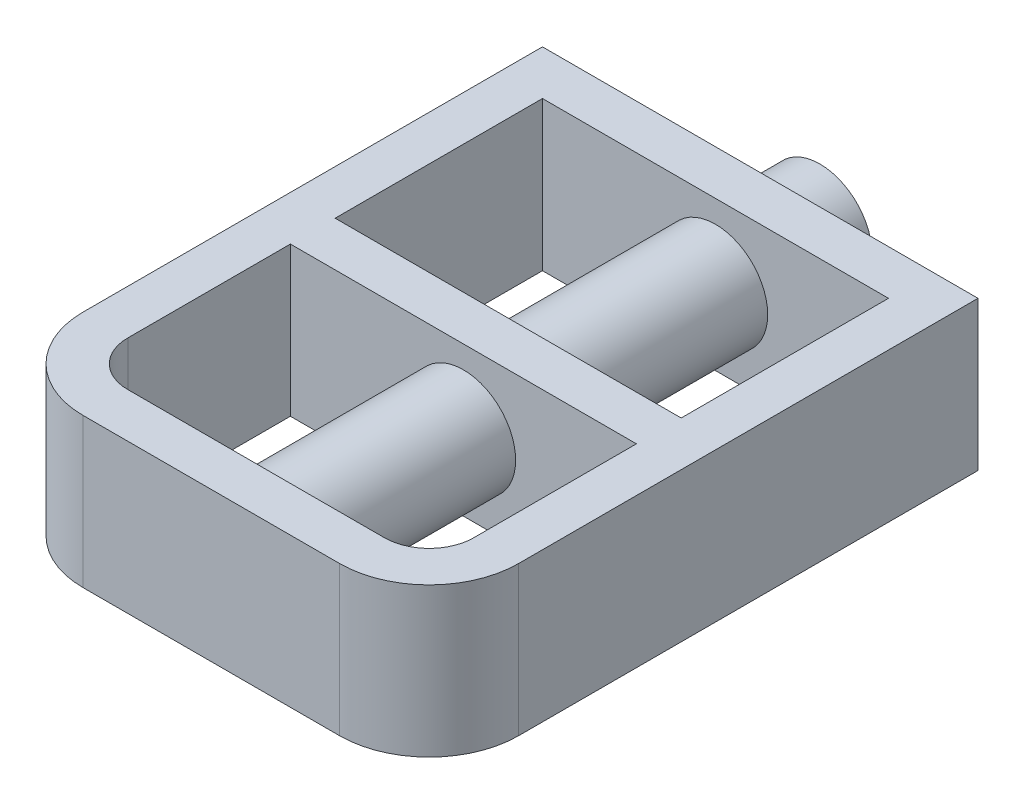
ISO-10303-21;
HEADER;
FILE_DESCRIPTION(('STEP AP214'),'2;1');
FILE_NAME('part.step','',(''),(''),'','','');
FILE_SCHEMA(('AUTOMOTIVE_DESIGN { 1 0 10303 214 1 1 1 1 }'));
ENDSEC;
DATA;
#1=APPLICATION_CONTEXT('core data for automotive mechanical design processes');
#2=APPLICATION_PROTOCOL_DEFINITION('international standard','automotive_design',2000,#1);
#3=PRODUCT_CONTEXT('',#1,'mechanical');
#4=PRODUCT('Part','Part','',(#3));
#5=PRODUCT_RELATED_PRODUCT_CATEGORY('part','',(#4));
#6=PRODUCT_DEFINITION_FORMATION('','',#4);
#7=PRODUCT_DEFINITION_CONTEXT('part definition',#1,'design');
#8=PRODUCT_DEFINITION('design','',#6,#7);
#9=PRODUCT_DEFINITION_SHAPE('','',#8);
#10=(LENGTH_UNIT() NAMED_UNIT(*) SI_UNIT(.MILLI.,.METRE.));
#11=(NAMED_UNIT(*) PLANE_ANGLE_UNIT() SI_UNIT($,.RADIAN.));
#12=(NAMED_UNIT(*) SI_UNIT($,.STERADIAN.) SOLID_ANGLE_UNIT());
#13=UNCERTAINTY_MEASURE_WITH_UNIT(LENGTH_MEASURE(1.E-05),#10,'distance_accuracy_value','');
#14=(GEOMETRIC_REPRESENTATION_CONTEXT(3) GLOBAL_UNCERTAINTY_ASSIGNED_CONTEXT((#13)) GLOBAL_UNIT_ASSIGNED_CONTEXT((#10,
#11,#12)) REPRESENTATION_CONTEXT('',''));
#15=CARTESIAN_POINT('',(0.,0.,0.));
#16=DIRECTION('',(0.,0.,1.));
#17=DIRECTION('',(1.,0.,0.));
#18=AXIS2_PLACEMENT_3D('',#15,#16,#17);
#19=CARTESIAN_POINT('',(21.5,12.5,31.));
#20=DIRECTION('',(0.,1.,0.));
#21=DIRECTION('',(0.,0.,1.));
#22=AXIS2_PLACEMENT_3D('',#19,#20,#21);
#23=PLANE('',#22);
#24=DIRECTION('',(0.,0.,1.));
#25=VECTOR('',#24,1.);
#26=CARTESIAN_POINT('',(-36.5,12.5,30.9999999999999));
#27=LINE('',#26,#25);
#28=CARTESIAN_POINT('',(-36.5,12.5,-46.));
#29=VERTEX_POINT('',#28);
#30=CARTESIAN_POINT('',(-36.5,12.5,30.9999999999999));
#31=VERTEX_POINT('',#30);
#32=EDGE_CURVE('E269',#29,#31,#27,.T.);
#33=ORIENTED_EDGE('',*,*,#32,.T.);
#34=CARTESIAN_POINT('',(-21.5,12.5,31.));
#35=DIRECTION('',(0.,1.,0.));
#36=DIRECTION('',(0.,0.,-1.));
#37=AXIS2_PLACEMENT_3D('',#34,#35,#36);
#38=CIRCLE('',#37,15.);
#39=CARTESIAN_POINT('',(-21.4999999999999,12.5,46.));
#40=VERTEX_POINT('',#39);
#41=EDGE_CURVE('E273',#31,#40,#38,.T.);
#42=ORIENTED_EDGE('',*,*,#41,.T.);
#43=DIRECTION('',(1.,0.,0.));
#44=VECTOR('',#43,1.);
#45=CARTESIAN_POINT('',(21.4999999999999,12.5,46.));
#46=LINE('',#45,#44);
#47=CARTESIAN_POINT('',(21.4999999999999,12.5,46.));
#48=VERTEX_POINT('',#47);
#49=EDGE_CURVE('E277',#40,#48,#46,.T.);
#50=ORIENTED_EDGE('',*,*,#49,.T.);
#51=CARTESIAN_POINT('',(21.5,12.5,31.));
#52=DIRECTION('',(0.,1.,0.));
#53=DIRECTION('',(0.,0.,1.));
#54=AXIS2_PLACEMENT_3D('',#51,#52,#53);
#55=CIRCLE('',#54,15.);
#56=CARTESIAN_POINT('',(36.5,12.5,30.9999999999999));
#57=VERTEX_POINT('',#56);
#58=EDGE_CURVE('E280',#48,#57,#55,.T.);
#59=ORIENTED_EDGE('',*,*,#58,.T.);
#60=DIRECTION('',(0.,0.,-1.));
#61=VECTOR('',#60,1.);
#62=CARTESIAN_POINT('',(36.5,12.5,30.9999999999999));
#63=LINE('',#62,#61);
#64=CARTESIAN_POINT('',(36.5,12.5,-46.));
#65=VERTEX_POINT('',#64);
#66=EDGE_CURVE('E283',#57,#65,#63,.T.);
#67=ORIENTED_EDGE('',*,*,#66,.T.);
#68=DIRECTION('',(-1.,0.,0.));
#69=VECTOR('',#68,1.);
#70=CARTESIAN_POINT('',(36.5,12.5,-46.));
#71=LINE('',#70,#69);
#72=EDGE_CURVE('E286',#65,#29,#71,.T.);
#73=ORIENTED_EDGE('',*,*,#72,.T.);
#74=EDGE_LOOP('',(#33,#42,#50,#59,#67,#73));
#75=FACE_BOUND('',#74,.T.);
#76=DIRECTION('',(1.,0.,0.));
#77=VECTOR('',#76,1.);
#78=CARTESIAN_POINT('',(21.4999999999999,12.5,38.5));
#79=LINE('',#78,#77);
#80=CARTESIAN_POINT('',(-21.4999999999999,12.5,38.5));
#81=VERTEX_POINT('',#80);
#82=CARTESIAN_POINT('',(21.4999999999999,12.5,38.5));
#83=VERTEX_POINT('',#82);
#84=EDGE_CURVE('E209',#81,#83,#79,.T.);
#85=ORIENTED_EDGE('',*,*,#84,.F.);
#86=CARTESIAN_POINT('',(-21.5,12.5,31.));
#87=DIRECTION('',(0.,1.,0.));
#88=DIRECTION('',(0.,0.,-1.));
#89=AXIS2_PLACEMENT_3D('',#86,#87,#88);
#90=CIRCLE('',#89,7.49999999999999);
#91=CARTESIAN_POINT('',(-29.,12.5,30.9999999999999));
#92=VERTEX_POINT('',#91);
#93=EDGE_CURVE('E206',#92,#81,#90,.T.);
#94=ORIENTED_EDGE('',*,*,#93,.F.);
#95=DIRECTION('',(0.,0.,1.));
#96=VECTOR('',#95,1.);
#97=CARTESIAN_POINT('',(-29.,12.5,30.9999999999999));
#98=LINE('',#97,#96);
#99=CARTESIAN_POINT('',(-29.,12.5,3.75000000000002));
#100=VERTEX_POINT('',#99);
#101=EDGE_CURVE('E223',#100,#92,#98,.T.);
#102=ORIENTED_EDGE('',*,*,#101,.F.);
#103=DIRECTION('',(-1.,0.,0.));
#104=VECTOR('',#103,1.);
#105=CARTESIAN_POINT('',(29.,12.5,3.75000000000002));
#106=LINE('',#105,#104);
#107=CARTESIAN_POINT('',(29.,12.5,3.75000000000002));
#108=VERTEX_POINT('',#107);
#109=EDGE_CURVE('E219',#108,#100,#106,.T.);
#110=ORIENTED_EDGE('',*,*,#109,.F.);
#111=DIRECTION('',(0.,0.,-1.));
#112=VECTOR('',#111,1.);
#113=CARTESIAN_POINT('',(29.,12.5,30.9999999999999));
#114=LINE('',#113,#112);
#115=CARTESIAN_POINT('',(29.,12.5,30.9999999999999));
#116=VERTEX_POINT('',#115);
#117=EDGE_CURVE('E216',#116,#108,#114,.T.);
#118=ORIENTED_EDGE('',*,*,#117,.F.);
#119=CARTESIAN_POINT('',(21.5,12.5,31.));
#120=DIRECTION('',(0.,1.,0.));
#121=DIRECTION('',(0.,0.,1.));
#122=AXIS2_PLACEMENT_3D('',#119,#120,#121);
#123=CIRCLE('',#122,7.5);
#124=EDGE_CURVE('E213',#83,#116,#123,.T.);
#125=ORIENTED_EDGE('',*,*,#124,.F.);
#126=EDGE_LOOP('',(#85,#94,#102,#110,#118,#125));
#127=FACE_BOUND('',#126,.T.);
#128=DIRECTION('',(1.,0.,0.));
#129=VECTOR('',#128,1.);
#130=CARTESIAN_POINT('',(29.,12.5,-3.74999999999998));
#131=LINE('',#130,#129);
#132=CARTESIAN_POINT('',(-29.,12.5,-3.74999999999998));
#133=VERTEX_POINT('',#132);
#134=CARTESIAN_POINT('',(29.,12.5,-3.74999999999998));
#135=VERTEX_POINT('',#134);
#136=EDGE_CURVE('E166',#133,#135,#131,.T.);
#137=ORIENTED_EDGE('',*,*,#136,.F.);
#138=DIRECTION('',(0.,0.,1.));
#139=VECTOR('',#138,1.);
#140=CARTESIAN_POINT('',(-29.,12.5,-3.74999999999998));
#141=LINE('',#140,#139);
#142=CARTESIAN_POINT('',(-29.,12.5,-38.5));
#143=VERTEX_POINT('',#142);
#144=EDGE_CURVE('E157',#143,#133,#141,.T.);
#145=ORIENTED_EDGE('',*,*,#144,.F.);
#146=DIRECTION('',(-1.,0.,0.));
#147=VECTOR('',#146,1.);
#148=CARTESIAN_POINT('',(29.,12.5,-38.5));
#149=LINE('',#148,#147);
#150=CARTESIAN_POINT('',(29.,12.5,-38.5));
#151=VERTEX_POINT('',#150);
#152=EDGE_CURVE('E183',#151,#143,#149,.T.);
#153=ORIENTED_EDGE('',*,*,#152,.F.);
#154=DIRECTION('',(0.,0.,-1.));
#155=VECTOR('',#154,1.);
#156=CARTESIAN_POINT('',(29.,12.5,-3.74999999999998));
#157=LINE('',#156,#155);
#158=EDGE_CURVE('E179',#135,#151,#157,.T.);
#159=ORIENTED_EDGE('',*,*,#158,.F.);
#160=EDGE_LOOP('',(#137,#145,#153,#159));
#161=FACE_BOUND('',#160,.T.);
#162=ADVANCED_FACE('F41',(#75,#127,#161),#23,.T.);
#163=CARTESIAN_POINT('',(21.5,-12.5,31.));
#164=DIRECTION('',(0.,1.,0.));
#165=DIRECTION('',(0.,0.,1.));
#166=AXIS2_PLACEMENT_3D('',#163,#164,#165);
#167=PLANE('',#166);
#168=CARTESIAN_POINT('',(-21.5,-12.5,31.));
#169=DIRECTION('',(0.,1.,0.));
#170=DIRECTION('',(0.,0.,-1.));
#171=AXIS2_PLACEMENT_3D('',#168,#169,#170);
#172=CIRCLE('',#171,7.49999999999999);
#173=CARTESIAN_POINT('',(-29.,-12.5,30.9999999999999));
#174=VERTEX_POINT('',#173);
#175=CARTESIAN_POINT('',(-21.4999999999999,-12.5,38.5));
#176=VERTEX_POINT('',#175);
#177=EDGE_CURVE('E175',#174,#176,#172,.T.);
#178=ORIENTED_EDGE('',*,*,#177,.T.);
#179=DIRECTION('',(1.,0.,0.));
#180=VECTOR('',#179,1.);
#181=CARTESIAN_POINT('',(21.4999999999999,-12.5,38.5));
#182=LINE('',#181,#180);
#183=CARTESIAN_POINT('',(21.4999999999999,-12.5,38.5));
#184=VERTEX_POINT('',#183);
#185=EDGE_CURVE('E230',#176,#184,#182,.T.);
#186=ORIENTED_EDGE('',*,*,#185,.T.);
#187=CARTESIAN_POINT('',(21.5,-12.5,31.));
#188=DIRECTION('',(0.,1.,0.));
#189=DIRECTION('',(0.,0.,1.));
#190=AXIS2_PLACEMENT_3D('',#187,#188,#189);
#191=CIRCLE('',#190,7.5);
#192=CARTESIAN_POINT('',(29.,-12.5,30.9999999999999));
#193=VERTEX_POINT('',#192);
#194=EDGE_CURVE('E234',#184,#193,#191,.T.);
#195=ORIENTED_EDGE('',*,*,#194,.T.);
#196=DIRECTION('',(0.,0.,-1.));
#197=VECTOR('',#196,1.);
#198=CARTESIAN_POINT('',(29.,-12.5,30.9999999999999));
#199=LINE('',#198,#197);
#200=CARTESIAN_POINT('',(29.,-12.5,3.75000000000002));
#201=VERTEX_POINT('',#200);
#202=EDGE_CURVE('E238',#193,#201,#199,.T.);
#203=ORIENTED_EDGE('',*,*,#202,.T.);
#204=DIRECTION('',(-1.,0.,0.));
#205=VECTOR('',#204,1.);
#206=CARTESIAN_POINT('',(29.,-12.5,3.75000000000002));
#207=LINE('',#206,#205);
#208=CARTESIAN_POINT('',(-29.,-12.5,3.75000000000002));
#209=VERTEX_POINT('',#208);
#210=EDGE_CURVE('E242',#201,#209,#207,.T.);
#211=ORIENTED_EDGE('',*,*,#210,.T.);
#212=DIRECTION('',(0.,0.,1.));
#213=VECTOR('',#212,1.);
#214=CARTESIAN_POINT('',(-29.,-12.5,30.9999999999999));
#215=LINE('',#214,#213);
#216=EDGE_CURVE('E210',#209,#174,#215,.T.);
#217=ORIENTED_EDGE('',*,*,#216,.T.);
#218=EDGE_LOOP('',(#178,#186,#195,#203,#211,#217));
#219=FACE_BOUND('',#218,.T.);
#220=DIRECTION('',(0.,0.,1.));
#221=VECTOR('',#220,1.);
#222=CARTESIAN_POINT('',(-36.5,-12.5,30.9999999999999));
#223=LINE('',#222,#221);
#224=CARTESIAN_POINT('',(-36.5,-12.5,-46.));
#225=VERTEX_POINT('',#224);
#226=CARTESIAN_POINT('',(-36.5,-12.5,30.9999999999999));
#227=VERTEX_POINT('',#226);
#228=EDGE_CURVE('E268',#225,#227,#223,.T.);
#229=ORIENTED_EDGE('',*,*,#228,.F.);
#230=DIRECTION('',(-1.,0.,0.));
#231=VECTOR('',#230,1.);
#232=CARTESIAN_POINT('',(36.5,-12.5,-46.));
#233=LINE('',#232,#231);
#234=CARTESIAN_POINT('',(36.5,-12.5,-46.));
#235=VERTEX_POINT('',#234);
#236=EDGE_CURVE('E274',#235,#225,#233,.T.);
#237=ORIENTED_EDGE('',*,*,#236,.F.);
#238=DIRECTION('',(0.,0.,-1.));
#239=VECTOR('',#238,1.);
#240=CARTESIAN_POINT('',(36.5,-12.5,30.9999999999999));
#241=LINE('',#240,#239);
#242=CARTESIAN_POINT('',(36.5,-12.5,30.9999999999999));
#243=VERTEX_POINT('',#242);
#244=EDGE_CURVE('E302',#243,#235,#241,.T.);
#245=ORIENTED_EDGE('',*,*,#244,.F.);
#246=CARTESIAN_POINT('',(21.5,-12.5,31.));
#247=DIRECTION('',(0.,1.,0.));
#248=DIRECTION('',(0.,0.,1.));
#249=AXIS2_PLACEMENT_3D('',#246,#247,#248);
#250=CIRCLE('',#249,15.);
#251=CARTESIAN_POINT('',(21.4999999999999,-12.5,46.));
#252=VERTEX_POINT('',#251);
#253=EDGE_CURVE('E299',#252,#243,#250,.T.);
#254=ORIENTED_EDGE('',*,*,#253,.F.);
#255=DIRECTION('',(1.,0.,0.));
#256=VECTOR('',#255,1.);
#257=CARTESIAN_POINT('',(21.4999999999999,-12.5,46.));
#258=LINE('',#257,#256);
#259=CARTESIAN_POINT('',(-21.4999999999999,-12.5,46.));
#260=VERTEX_POINT('',#259);
#261=EDGE_CURVE('E296',#260,#252,#258,.T.);
#262=ORIENTED_EDGE('',*,*,#261,.F.);
#263=CARTESIAN_POINT('',(-21.5,-12.5,31.));
#264=DIRECTION('',(0.,1.,0.));
#265=DIRECTION('',(0.,0.,-1.));
#266=AXIS2_PLACEMENT_3D('',#263,#264,#265);
#267=CIRCLE('',#266,15.);
#268=EDGE_CURVE('E293',#227,#260,#267,.T.);
#269=ORIENTED_EDGE('',*,*,#268,.F.);
#270=EDGE_LOOP('',(#229,#237,#245,#254,#262,#269));
#271=FACE_BOUND('',#270,.T.);
#272=DIRECTION('',(0.,0.,1.));
#273=VECTOR('',#272,1.);
#274=CARTESIAN_POINT('',(-29.,-12.5,-3.74999999999998));
#275=LINE('',#274,#273);
#276=CARTESIAN_POINT('',(-29.,-12.5,-38.5));
#277=VERTEX_POINT('',#276);
#278=CARTESIAN_POINT('',(-29.,-12.5,-3.74999999999998));
#279=VERTEX_POINT('',#278);
#280=EDGE_CURVE('E67',#277,#279,#275,.T.);
#281=ORIENTED_EDGE('',*,*,#280,.T.);
#282=DIRECTION('',(1.,0.,0.));
#283=VECTOR('',#282,1.);
#284=CARTESIAN_POINT('',(29.,-12.5,-3.74999999999998));
#285=LINE('',#284,#283);
#286=CARTESIAN_POINT('',(29.,-12.5,-3.74999999999998));
#287=VERTEX_POINT('',#286);
#288=EDGE_CURVE('E173',#279,#287,#285,.T.);
#289=ORIENTED_EDGE('',*,*,#288,.T.);
#290=DIRECTION('',(0.,0.,-1.));
#291=VECTOR('',#290,1.);
#292=CARTESIAN_POINT('',(29.,-12.5,-3.74999999999998));
#293=LINE('',#292,#291);
#294=CARTESIAN_POINT('',(29.,-12.5,-38.5));
#295=VERTEX_POINT('',#294);
#296=EDGE_CURVE('E193',#287,#295,#293,.T.);
#297=ORIENTED_EDGE('',*,*,#296,.T.);
#298=DIRECTION('',(-1.,0.,0.));
#299=VECTOR('',#298,1.);
#300=CARTESIAN_POINT('',(29.,-12.5,-38.5));
#301=LINE('',#300,#299);
#302=EDGE_CURVE('E167',#295,#277,#301,.T.);
#303=ORIENTED_EDGE('',*,*,#302,.T.);
#304=EDGE_LOOP('',(#281,#289,#297,#303));
#305=FACE_BOUND('',#304,.T.);
#306=ADVANCED_FACE('F337',(#219,#271,#305),#167,.F.);
#307=CARTESIAN_POINT('',(-36.5,12.5,30.9999999999999));
#308=DIRECTION('',(1.,0.,0.));
#309=DIRECTION('',(0.,0.,-1.));
#310=AXIS2_PLACEMENT_3D('',#307,#308,#309);
#311=PLANE('',#310);
#312=ORIENTED_EDGE('',*,*,#228,.T.);
#313=DIRECTION('',(0.,-1.,0.));
#314=VECTOR('',#313,1.);
#315=CARTESIAN_POINT('',(-36.5,12.5,30.9999999999999));
#316=LINE('',#315,#314);
#317=EDGE_CURVE('E51',#31,#227,#316,.T.);
#318=ORIENTED_EDGE('',*,*,#317,.F.);
#319=ORIENTED_EDGE('',*,*,#32,.F.);
#320=DIRECTION('',(0.,-1.,0.));
#321=VECTOR('',#320,1.);
#322=CARTESIAN_POINT('',(-36.5,12.5,-46.));
#323=LINE('',#322,#321);
#324=EDGE_CURVE('E289',#29,#225,#323,.T.);
#325=ORIENTED_EDGE('',*,*,#324,.T.);
#326=EDGE_LOOP('',(#312,#318,#319,#325));
#327=FACE_BOUND('',#326,.T.);
#328=ADVANCED_FACE('F43',(#327),#311,.F.);
#329=CARTESIAN_POINT('',(-21.5,12.5,31.));
#330=DIRECTION('',(0.,-1.,0.));
#331=DIRECTION('',(0.,0.,-1.));
#332=AXIS2_PLACEMENT_3D('',#329,#330,#331);
#333=CYLINDRICAL_SURFACE('',#332,15.);
#334=ORIENTED_EDGE('',*,*,#268,.T.);
#335=DIRECTION('',(0.,-1.,0.));
#336=VECTOR('',#335,1.);
#337=CARTESIAN_POINT('',(-21.4999999999999,12.5,46.));
#338=LINE('',#337,#336);
#339=EDGE_CURVE('E322',#40,#260,#338,.T.);
#340=ORIENTED_EDGE('',*,*,#339,.F.);
#341=ORIENTED_EDGE('',*,*,#41,.F.);
#342=ORIENTED_EDGE('',*,*,#317,.T.);
#343=EDGE_LOOP('',(#334,#340,#341,#342));
#344=FACE_BOUND('',#343,.T.);
#345=ADVANCED_FACE('F329',(#344),#333,.T.);
#346=CARTESIAN_POINT('',(21.4999999999999,12.5,46.));
#347=DIRECTION('',(0.,0.,-1.));
#348=DIRECTION('',(-1.,0.,0.));
#349=AXIS2_PLACEMENT_3D('',#346,#347,#348);
#350=PLANE('',#349);
#351=ORIENTED_EDGE('',*,*,#261,.T.);
#352=DIRECTION('',(0.,-1.,0.));
#353=VECTOR('',#352,1.);
#354=CARTESIAN_POINT('',(21.4999999999999,12.5,46.));
#355=LINE('',#354,#353);
#356=EDGE_CURVE('E318',#48,#252,#355,.T.);
#357=ORIENTED_EDGE('',*,*,#356,.F.);
#358=ORIENTED_EDGE('',*,*,#49,.F.);
#359=ORIENTED_EDGE('',*,*,#339,.T.);
#360=EDGE_LOOP('',(#351,#357,#358,#359));
#361=FACE_BOUND('',#360,.T.);
#362=ADVANCED_FACE('F344',(#361),#350,.F.);
#363=CARTESIAN_POINT('',(21.5,12.5,31.));
#364=DIRECTION('',(0.,-1.,0.));
#365=DIRECTION('',(0.,0.,-1.));
#366=AXIS2_PLACEMENT_3D('',#363,#364,#365);
#367=CYLINDRICAL_SURFACE('',#366,15.);
#368=ORIENTED_EDGE('',*,*,#253,.T.);
#369=DIRECTION('',(0.,-1.,0.));
#370=VECTOR('',#369,1.);
#371=CARTESIAN_POINT('',(36.5,12.5,30.9999999999999));
#372=LINE('',#371,#370);
#373=EDGE_CURVE('E314',#57,#243,#372,.T.);
#374=ORIENTED_EDGE('',*,*,#373,.F.);
#375=ORIENTED_EDGE('',*,*,#58,.F.);
#376=ORIENTED_EDGE('',*,*,#356,.T.);
#377=EDGE_LOOP('',(#368,#374,#375,#376));
#378=FACE_BOUND('',#377,.T.);
#379=ADVANCED_FACE('F348',(#378),#367,.T.);
#380=CARTESIAN_POINT('',(36.5,12.5,30.9999999999999));
#381=DIRECTION('',(-1.,0.,0.));
#382=DIRECTION('',(0.,0.,1.));
#383=AXIS2_PLACEMENT_3D('',#380,#381,#382);
#384=PLANE('',#383);
#385=ORIENTED_EDGE('',*,*,#244,.T.);
#386=DIRECTION('',(0.,-1.,0.));
#387=VECTOR('',#386,1.);
#388=CARTESIAN_POINT('',(36.5,12.5,-46.));
#389=LINE('',#388,#387);
#390=EDGE_CURVE('E310',#65,#235,#389,.T.);
#391=ORIENTED_EDGE('',*,*,#390,.F.);
#392=ORIENTED_EDGE('',*,*,#66,.F.);
#393=ORIENTED_EDGE('',*,*,#373,.T.);
#394=EDGE_LOOP('',(#385,#391,#392,#393));
#395=FACE_BOUND('',#394,.T.);
#396=ADVANCED_FACE('F358',(#395),#384,.F.);
#397=CARTESIAN_POINT('',(36.5,12.5,-46.));
#398=DIRECTION('',(0.,0.,1.));
#399=DIRECTION('',(1.,0.,0.));
#400=AXIS2_PLACEMENT_3D('',#397,#398,#399);
#401=PLANE('',#400);
#402=CARTESIAN_POINT('',(0.,0.,-46.));
#403=DIRECTION('',(0.,0.,1.));
#404=DIRECTION('',(1.,0.,0.));
#405=AXIS2_PLACEMENT_3D('',#402,#403,#404);
#406=CIRCLE('',#405,8.75);
#407=CARTESIAN_POINT('',(8.75,0.,-46.));
#408=VERTEX_POINT('',#407);
#409=EDGE_CURVE('E11',#408,#408,#406,.F.);
#410=ORIENTED_EDGE('',*,*,#409,.F.);
#411=EDGE_LOOP('',(#410));
#412=FACE_BOUND('',#411,.T.);
#413=ORIENTED_EDGE('',*,*,#236,.T.);
#414=ORIENTED_EDGE('',*,*,#324,.F.);
#415=ORIENTED_EDGE('',*,*,#72,.F.);
#416=ORIENTED_EDGE('',*,*,#390,.T.);
#417=EDGE_LOOP('',(#413,#414,#415,#416));
#418=FACE_BOUND('',#417,.T.);
#419=ADVANCED_FACE('F356',(#412,#418),#401,.F.);
#420=CARTESIAN_POINT('',(-21.5,12.5,31.));
#421=DIRECTION('',(0.,-1.,0.));
#422=DIRECTION('',(0.,0.,-1.));
#423=AXIS2_PLACEMENT_3D('',#420,#421,#422);
#424=CYLINDRICAL_SURFACE('',#423,7.49999999999999);
#425=ORIENTED_EDGE('',*,*,#177,.F.);
#426=DIRECTION('',(0.,-1.,0.));
#427=VECTOR('',#426,1.);
#428=CARTESIAN_POINT('',(-29.,12.5,30.9999999999999));
#429=LINE('',#428,#427);
#430=EDGE_CURVE('E226',#92,#174,#429,.T.);
#431=ORIENTED_EDGE('',*,*,#430,.F.);
#432=ORIENTED_EDGE('',*,*,#93,.T.);
#433=DIRECTION('',(0.,-1.,0.));
#434=VECTOR('',#433,1.);
#435=CARTESIAN_POINT('',(-21.4999999999999,12.5,38.5));
#436=LINE('',#435,#434);
#437=EDGE_CURVE('E264',#81,#176,#436,.T.);
#438=ORIENTED_EDGE('',*,*,#437,.T.);
#439=EDGE_LOOP('',(#425,#431,#432,#438));
#440=FACE_BOUND('',#439,.T.);
#441=ADVANCED_FACE('F365',(#440),#424,.F.);
#442=CARTESIAN_POINT('',(21.4999999999999,12.5,38.5));
#443=DIRECTION('',(0.,0.,-1.));
#444=DIRECTION('',(-1.,0.,0.));
#445=AXIS2_PLACEMENT_3D('',#442,#443,#444);
#446=PLANE('',#445);
#447=CARTESIAN_POINT('',(0.,0.,38.5));
#448=DIRECTION('',(0.,0.,-1.));
#449=DIRECTION('',(-1.,0.,0.));
#450=AXIS2_PLACEMENT_3D('',#447,#448,#449);
#451=CIRCLE('',#450,8.75);
#452=CARTESIAN_POINT('',(-8.75,0.,38.5));
#453=VERTEX_POINT('',#452);
#454=EDGE_CURVE('E436',#453,#453,#451,.F.);
#455=ORIENTED_EDGE('',*,*,#454,.T.);
#456=EDGE_LOOP('',(#455));
#457=FACE_BOUND('',#456,.T.);
#458=ORIENTED_EDGE('',*,*,#185,.F.);
#459=ORIENTED_EDGE('',*,*,#437,.F.);
#460=ORIENTED_EDGE('',*,*,#84,.T.);
#461=DIRECTION('',(0.,-1.,0.));
#462=VECTOR('',#461,1.);
#463=CARTESIAN_POINT('',(21.4999999999999,12.5,38.5));
#464=LINE('',#463,#462);
#465=EDGE_CURVE('E261',#83,#184,#464,.T.);
#466=ORIENTED_EDGE('',*,*,#465,.T.);
#467=EDGE_LOOP('',(#458,#459,#460,#466));
#468=FACE_BOUND('',#467,.T.);
#469=ADVANCED_FACE('F379',(#457,#468),#446,.T.);
#470=CARTESIAN_POINT('',(21.5,12.5,31.));
#471=DIRECTION('',(0.,-1.,0.));
#472=DIRECTION('',(0.,0.,-1.));
#473=AXIS2_PLACEMENT_3D('',#470,#471,#472);
#474=CYLINDRICAL_SURFACE('',#473,7.5);
#475=ORIENTED_EDGE('',*,*,#194,.F.);
#476=ORIENTED_EDGE('',*,*,#465,.F.);
#477=ORIENTED_EDGE('',*,*,#124,.T.);
#478=DIRECTION('',(0.,-1.,0.));
#479=VECTOR('',#478,1.);
#480=CARTESIAN_POINT('',(29.,12.5,30.9999999999999));
#481=LINE('',#480,#479);
#482=EDGE_CURVE('E258',#116,#193,#481,.T.);
#483=ORIENTED_EDGE('',*,*,#482,.T.);
#484=EDGE_LOOP('',(#475,#476,#477,#483));
#485=FACE_BOUND('',#484,.T.);
#486=ADVANCED_FACE('F383',(#485),#474,.F.);
#487=CARTESIAN_POINT('',(29.,12.5,30.9999999999999));
#488=DIRECTION('',(-1.,0.,0.));
#489=DIRECTION('',(0.,0.,1.));
#490=AXIS2_PLACEMENT_3D('',#487,#488,#489);
#491=PLANE('',#490);
#492=ORIENTED_EDGE('',*,*,#202,.F.);
#493=ORIENTED_EDGE('',*,*,#482,.F.);
#494=ORIENTED_EDGE('',*,*,#117,.T.);
#495=DIRECTION('',(0.,-1.,0.));
#496=VECTOR('',#495,1.);
#497=CARTESIAN_POINT('',(29.,12.5,3.75000000000002));
#498=LINE('',#497,#496);
#499=EDGE_CURVE('E255',#108,#201,#498,.T.);
#500=ORIENTED_EDGE('',*,*,#499,.T.);
#501=EDGE_LOOP('',(#492,#493,#494,#500));
#502=FACE_BOUND('',#501,.T.);
#503=ADVANCED_FACE('F387',(#502),#491,.T.);
#504=CARTESIAN_POINT('',(29.,12.5,3.75000000000002));
#505=DIRECTION('',(0.,0.,1.));
#506=DIRECTION('',(1.,0.,0.));
#507=AXIS2_PLACEMENT_3D('',#504,#505,#506);
#508=PLANE('',#507);
#509=CARTESIAN_POINT('',(0.,0.,3.75000000000002));
#510=DIRECTION('',(0.,0.,1.));
#511=DIRECTION('',(1.,0.,0.));
#512=AXIS2_PLACEMENT_3D('',#509,#510,#511);
#513=CIRCLE('',#512,8.75);
#514=CARTESIAN_POINT('',(8.75,0.,3.75000000000002));
#515=VERTEX_POINT('',#514);
#516=EDGE_CURVE('E190',#515,#515,#513,.F.);
#517=ORIENTED_EDGE('',*,*,#516,.T.);
#518=EDGE_LOOP('',(#517));
#519=FACE_BOUND('',#518,.T.);
#520=ORIENTED_EDGE('',*,*,#210,.F.);
#521=ORIENTED_EDGE('',*,*,#499,.F.);
#522=ORIENTED_EDGE('',*,*,#109,.T.);
#523=DIRECTION('',(0.,-1.,0.));
#524=VECTOR('',#523,1.);
#525=CARTESIAN_POINT('',(-29.,12.5,3.75000000000002));
#526=LINE('',#525,#524);
#527=EDGE_CURVE('E252',#100,#209,#526,.T.);
#528=ORIENTED_EDGE('',*,*,#527,.T.);
#529=EDGE_LOOP('',(#520,#521,#522,#528));
#530=FACE_BOUND('',#529,.T.);
#531=ADVANCED_FACE('F391',(#519,#530),#508,.T.);
#532=CARTESIAN_POINT('',(-29.,12.5,30.9999999999999));
#533=DIRECTION('',(1.,0.,0.));
#534=DIRECTION('',(0.,0.,-1.));
#535=AXIS2_PLACEMENT_3D('',#532,#533,#534);
#536=PLANE('',#535);
#537=ORIENTED_EDGE('',*,*,#216,.F.);
#538=ORIENTED_EDGE('',*,*,#527,.F.);
#539=ORIENTED_EDGE('',*,*,#101,.T.);
#540=ORIENTED_EDGE('',*,*,#430,.T.);
#541=EDGE_LOOP('',(#537,#538,#539,#540));
#542=FACE_BOUND('',#541,.T.);
#543=ADVANCED_FACE('F395',(#542),#536,.T.);
#544=CARTESIAN_POINT('',(-29.,12.5,-3.74999999999998));
#545=DIRECTION('',(1.,0.,0.));
#546=DIRECTION('',(0.,0.,-1.));
#547=AXIS2_PLACEMENT_3D('',#544,#545,#546);
#548=PLANE('',#547);
#549=ORIENTED_EDGE('',*,*,#280,.F.);
#550=DIRECTION('',(0.,-1.,0.));
#551=VECTOR('',#550,1.);
#552=CARTESIAN_POINT('',(-29.,12.5,-38.5));
#553=LINE('',#552,#551);
#554=EDGE_CURVE('E161',#143,#277,#553,.T.);
#555=ORIENTED_EDGE('',*,*,#554,.F.);
#556=ORIENTED_EDGE('',*,*,#144,.T.);
#557=DIRECTION('',(0.,-1.,0.));
#558=VECTOR('',#557,1.);
#559=CARTESIAN_POINT('',(-29.,12.5,-3.74999999999998));
#560=LINE('',#559,#558);
#561=EDGE_CURVE('E160',#133,#279,#560,.T.);
#562=ORIENTED_EDGE('',*,*,#561,.T.);
#563=EDGE_LOOP('',(#549,#555,#556,#562));
#564=FACE_BOUND('',#563,.T.);
#565=ADVANCED_FACE('F159',(#564),#548,.T.);
#566=CARTESIAN_POINT('',(29.,12.5,-3.74999999999998));
#567=DIRECTION('',(0.,0.,-1.));
#568=DIRECTION('',(-1.,0.,0.));
#569=AXIS2_PLACEMENT_3D('',#566,#567,#568);
#570=PLANE('',#569);
#571=CARTESIAN_POINT('',(0.,0.,-3.74999999999998));
#572=DIRECTION('',(0.,0.,-1.));
#573=DIRECTION('',(-1.,0.,0.));
#574=AXIS2_PLACEMENT_3D('',#571,#572,#573);
#575=CIRCLE('',#574,8.75);
#576=CARTESIAN_POINT('',(-8.75,0.,-3.74999999999998));
#577=VERTEX_POINT('',#576);
#578=EDGE_CURVE('E450',#577,#577,#575,.F.);
#579=ORIENTED_EDGE('',*,*,#578,.T.);
#580=EDGE_LOOP('',(#579));
#581=FACE_BOUND('',#580,.T.);
#582=ORIENTED_EDGE('',*,*,#288,.F.);
#583=ORIENTED_EDGE('',*,*,#561,.F.);
#584=ORIENTED_EDGE('',*,*,#136,.T.);
#585=DIRECTION('',(0.,-1.,0.));
#586=VECTOR('',#585,1.);
#587=CARTESIAN_POINT('',(29.,12.5,-3.74999999999998));
#588=LINE('',#587,#586);
#589=EDGE_CURVE('E176',#135,#287,#588,.T.);
#590=ORIENTED_EDGE('',*,*,#589,.T.);
#591=EDGE_LOOP('',(#582,#583,#584,#590));
#592=FACE_BOUND('',#591,.T.);
#593=ADVANCED_FACE('F170',(#581,#592),#570,.T.);
#594=CARTESIAN_POINT('',(29.,12.5,-3.74999999999998));
#595=DIRECTION('',(-1.,0.,0.));
#596=DIRECTION('',(0.,0.,1.));
#597=AXIS2_PLACEMENT_3D('',#594,#595,#596);
#598=PLANE('',#597);
#599=ORIENTED_EDGE('',*,*,#296,.F.);
#600=ORIENTED_EDGE('',*,*,#589,.F.);
#601=ORIENTED_EDGE('',*,*,#158,.T.);
#602=DIRECTION('',(0.,-1.,0.));
#603=VECTOR('',#602,1.);
#604=CARTESIAN_POINT('',(29.,12.5,-38.5));
#605=LINE('',#604,#603);
#606=EDGE_CURVE('E59',#151,#295,#605,.T.);
#607=ORIENTED_EDGE('',*,*,#606,.T.);
#608=EDGE_LOOP('',(#599,#600,#601,#607));
#609=FACE_BOUND('',#608,.T.);
#610=ADVANCED_FACE('F404',(#609),#598,.T.);
#611=CARTESIAN_POINT('',(29.,12.5,-38.5));
#612=DIRECTION('',(0.,0.,1.));
#613=DIRECTION('',(1.,0.,0.));
#614=AXIS2_PLACEMENT_3D('',#611,#612,#613);
#615=PLANE('',#614);
#616=CARTESIAN_POINT('',(0.,0.,-38.5));
#617=DIRECTION('',(0.,0.,1.));
#618=DIRECTION('',(1.,0.,0.));
#619=AXIS2_PLACEMENT_3D('',#616,#617,#618);
#620=CIRCLE('',#619,8.75);
#621=CARTESIAN_POINT('',(8.75,0.,-38.5));
#622=VERTEX_POINT('',#621);
#623=EDGE_CURVE('E45',#622,#622,#620,.F.);
#624=ORIENTED_EDGE('',*,*,#623,.T.);
#625=EDGE_LOOP('',(#624));
#626=FACE_BOUND('',#625,.T.);
#627=ORIENTED_EDGE('',*,*,#302,.F.);
#628=ORIENTED_EDGE('',*,*,#606,.F.);
#629=ORIENTED_EDGE('',*,*,#152,.T.);
#630=ORIENTED_EDGE('',*,*,#554,.T.);
#631=EDGE_LOOP('',(#627,#628,#629,#630));
#632=FACE_BOUND('',#631,.T.);
#633=ADVANCED_FACE('F408',(#626,#632),#615,.T.);
#634=CARTESIAN_POINT('',(0.,0.,-56.));
#635=DIRECTION('',(0.,0.,1.));
#636=DIRECTION('',(1.,0.,0.));
#637=AXIS2_PLACEMENT_3D('',#634,#635,#636);
#638=CYLINDRICAL_SURFACE('',#637,8.75);
#639=ORIENTED_EDGE('',*,*,#578,.F.);
#640=EDGE_LOOP('',(#639));
#641=FACE_BOUND('',#640,.T.);
#642=ORIENTED_EDGE('',*,*,#623,.F.);
#643=EDGE_LOOP('',(#642));
#644=FACE_BOUND('',#643,.T.);
#645=ADVANCED_FACE('F412',(#641,#644),#638,.T.);
#646=ORIENTED_EDGE('',*,*,#516,.F.);
#647=EDGE_LOOP('',(#646));
#648=FACE_BOUND('',#647,.T.);
#649=ORIENTED_EDGE('',*,*,#454,.F.);
#650=EDGE_LOOP('',(#649));
#651=FACE_BOUND('',#650,.T.);
#652=ADVANCED_FACE('F416',(#648,#651),#638,.T.);
#653=CARTESIAN_POINT('',(0.,0.,-56.));
#654=DIRECTION('',(0.,0.,-1.));
#655=DIRECTION('',(-1.,0.,0.));
#656=AXIS2_PLACEMENT_3D('',#653,#654,#655);
#657=CIRCLE('',#656,8.75);
#658=CARTESIAN_POINT('',(-8.75000000000001,0.,-56.));
#659=VERTEX_POINT('',#658);
#660=EDGE_CURVE('E442',#659,#659,#657,.T.);
#661=ORIENTED_EDGE('',*,*,#660,.F.);
#662=EDGE_LOOP('',(#661));
#663=FACE_BOUND('',#662,.T.);
#664=ORIENTED_EDGE('',*,*,#409,.T.);
#665=EDGE_LOOP('',(#664));
#666=FACE_BOUND('',#665,.T.);
#667=ADVANCED_FACE('F418',(#663,#666),#638,.T.);
#668=CARTESIAN_POINT('',(0.,0.,-56.));
#669=DIRECTION('',(0.,0.,-1.));
#670=DIRECTION('',(-1.,0.,0.));
#671=AXIS2_PLACEMENT_3D('',#668,#669,#670);
#672=PLANE('',#671);
#673=CARTESIAN_POINT('',(0.,0.,-56.));
#674=DIRECTION('',(0.,0.,-1.));
#675=DIRECTION('',(-1.,0.,0.));
#676=AXIS2_PLACEMENT_3D('',#673,#674,#675);
#677=CIRCLE('',#676,5.);
#678=CARTESIAN_POINT('',(-5.00000000000001,0.,-56.));
#679=VERTEX_POINT('',#678);
#680=EDGE_CURVE('E437',#679,#679,#677,.T.);
#681=ORIENTED_EDGE('',*,*,#680,.F.);
#682=EDGE_LOOP('',(#681));
#683=FACE_BOUND('',#682,.T.);
#684=ORIENTED_EDGE('',*,*,#660,.T.);
#685=EDGE_LOOP('',(#684));
#686=FACE_BOUND('',#685,.T.);
#687=ADVANCED_FACE('F419',(#683,#686),#672,.T.);
#688=CARTESIAN_POINT('',(0.,0.,52.642135623731));
#689=DIRECTION('',(0.,0.,-1.));
#690=DIRECTION('',(-1.,0.,0.));
#691=AXIS2_PLACEMENT_3D('',#688,#689,#690);
#692=CYLINDRICAL_SURFACE('',#691,5.);
#693=CARTESIAN_POINT('',(0.,0.,38.5));
#694=DIRECTION('',(0.,0.,-1.));
#695=DIRECTION('',(-1.,0.,0.));
#696=AXIS2_PLACEMENT_3D('',#693,#694,#695);
#697=CIRCLE('',#696,5.);
#698=CARTESIAN_POINT('',(-5.,0.,38.5));
#699=VERTEX_POINT('',#698);
#700=EDGE_CURVE('E434',#699,#699,#697,.F.);
#701=ORIENTED_EDGE('',*,*,#700,.T.);
#702=EDGE_LOOP('',(#701));
#703=FACE_BOUND('',#702,.T.);
#704=ORIENTED_EDGE('',*,*,#680,.T.);
#705=EDGE_LOOP('',(#704));
#706=FACE_BOUND('',#705,.T.);
#707=ADVANCED_FACE('F422',(#703,#706),#692,.F.);
#708=CARTESIAN_POINT('',(21.4999999999999,12.5,38.5));
#709=DIRECTION('',(0.,0.,-1.));
#710=DIRECTION('',(-1.,0.,0.));
#711=AXIS2_PLACEMENT_3D('',#708,#709,#710);
#712=PLANE('',#711);
#713=ORIENTED_EDGE('',*,*,#700,.F.);
#714=EDGE_LOOP('',(#713));
#715=FACE_BOUND('',#714,.T.);
#716=ADVANCED_FACE('F426',(#715),#712,.T.);
#717=CLOSED_SHELL('',(#162,#306,#328,#345,#362,#379,#396,#419,#441,#469,#486,#503,#531,#543,
#565,#593,#610,#633,#645,#652,#667,#687,#707,#716));
#718=MANIFOLD_SOLID_BREP('B2',#717);
#719=ADVANCED_BREP_SHAPE_REPRESENTATION('',(#18,#718),#14);
#720=SHAPE_DEFINITION_REPRESENTATION(#9,#719);
ENDSEC;
END-ISO-10303-21;
